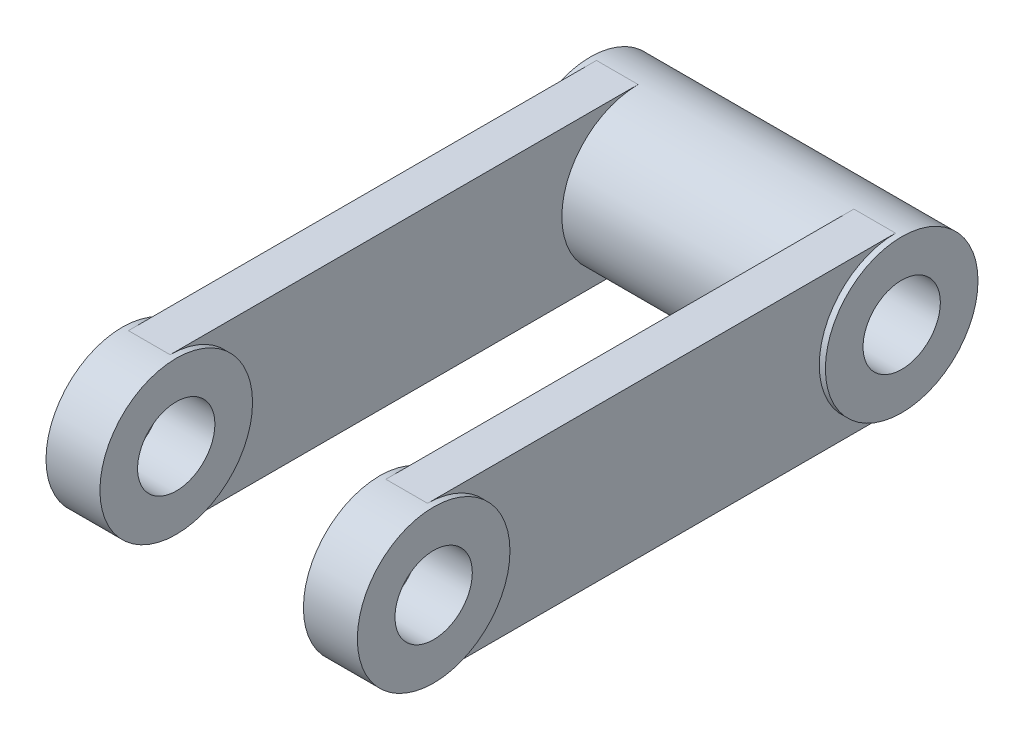
ISO-10303-21;
HEADER;
FILE_DESCRIPTION(('STEP AP214'),'2;1');
FILE_NAME('part.step','',(''),(''),'','','');
FILE_SCHEMA(('AUTOMOTIVE_DESIGN { 1 0 10303 214 1 1 1 1 }'));
ENDSEC;
DATA;
#1=APPLICATION_CONTEXT('core data for automotive mechanical design processes');
#2=APPLICATION_PROTOCOL_DEFINITION('international standard','automotive_design',2000,#1);
#3=PRODUCT_CONTEXT('',#1,'mechanical');
#4=PRODUCT('Part','Part','',(#3));
#5=PRODUCT_RELATED_PRODUCT_CATEGORY('part','',(#4));
#6=PRODUCT_DEFINITION_FORMATION('','',#4);
#7=PRODUCT_DEFINITION_CONTEXT('part definition',#1,'design');
#8=PRODUCT_DEFINITION('design','',#6,#7);
#9=PRODUCT_DEFINITION_SHAPE('','',#8);
#10=(LENGTH_UNIT() NAMED_UNIT(*) SI_UNIT(.MILLI.,.METRE.));
#11=(NAMED_UNIT(*) PLANE_ANGLE_UNIT() SI_UNIT($,.RADIAN.));
#12=(NAMED_UNIT(*) SI_UNIT($,.STERADIAN.) SOLID_ANGLE_UNIT());
#13=UNCERTAINTY_MEASURE_WITH_UNIT(LENGTH_MEASURE(1.E-05),#10,'distance_accuracy_value','');
#14=(GEOMETRIC_REPRESENTATION_CONTEXT(3) GLOBAL_UNCERTAINTY_ASSIGNED_CONTEXT((#13)) GLOBAL_UNIT_ASSIGNED_CONTEXT((#10,
#11,#12)) REPRESENTATION_CONTEXT('',''));
#15=CARTESIAN_POINT('',(0.,0.,0.));
#16=DIRECTION('',(0.,0.,1.));
#17=DIRECTION('',(1.,0.,0.));
#18=AXIS2_PLACEMENT_3D('',#15,#16,#17);
#19=CARTESIAN_POINT('',(153.,0.,0.));
#20=DIRECTION('',(-1.,0.,0.));
#21=DIRECTION('',(0.,0.,1.));
#22=AXIS2_PLACEMENT_3D('',#19,#20,#21);
#23=CYLINDRICAL_SURFACE('',#22,75.);
#24=DIRECTION('',(-1.,0.,0.));
#25=VECTOR('',#24,1.);
#26=CARTESIAN_POINT('',(147.,-75.,0.));
#27=LINE('',#26,#25);
#28=CARTESIAN_POINT('',(147.,-75.,0.));
#29=VERTEX_POINT('',#28);
#30=CARTESIAN_POINT('',(106.,-75.,0.));
#31=VERTEX_POINT('',#30);
#32=EDGE_CURVE('E51',#29,#31,#27,.T.);
#33=ORIENTED_EDGE('',*,*,#32,.F.);
#34=CARTESIAN_POINT('',(147.,0.,0.));
#35=DIRECTION('',(1.,0.,0.));
#36=DIRECTION('',(0.,0.,-1.));
#37=AXIS2_PLACEMENT_3D('',#34,#35,#36);
#38=CIRCLE('',#37,75.);
#39=CARTESIAN_POINT('',(147.,75.,0.));
#40=VERTEX_POINT('',#39);
#41=EDGE_CURVE('E56',#29,#40,#38,.T.);
#42=ORIENTED_EDGE('',*,*,#41,.T.);
#43=DIRECTION('',(-1.,0.,0.));
#44=VECTOR('',#43,1.);
#45=CARTESIAN_POINT('',(147.,75.,0.));
#46=LINE('',#45,#44);
#47=CARTESIAN_POINT('',(106.,75.,0.));
#48=VERTEX_POINT('',#47);
#49=EDGE_CURVE('E166',#40,#48,#46,.T.);
#50=ORIENTED_EDGE('',*,*,#49,.T.);
#51=CARTESIAN_POINT('',(106.,0.,0.));
#52=DIRECTION('',(1.,0.,0.));
#53=DIRECTION('',(0.,0.,-1.));
#54=AXIS2_PLACEMENT_3D('',#51,#52,#53);
#55=CIRCLE('',#54,75.);
#56=EDGE_CURVE('E155',#31,#48,#55,.T.);
#57=ORIENTED_EDGE('',*,*,#56,.F.);
#58=EDGE_LOOP('',(#33,#42,#50,#57));
#59=FACE_BOUND('',#58,.T.);
#60=CARTESIAN_POINT('',(153.,0.,0.));
#61=DIRECTION('',(1.,0.,0.));
#62=DIRECTION('',(0.,0.,-1.));
#63=AXIS2_PLACEMENT_3D('',#60,#61,#62);
#64=CIRCLE('',#63,75.);
#65=CARTESIAN_POINT('',(153.,0.,-75.));
#66=VERTEX_POINT('',#65);
#67=EDGE_CURVE('E43',#66,#66,#64,.T.);
#68=ORIENTED_EDGE('',*,*,#67,.F.);
#69=EDGE_LOOP('',(#68));
#70=FACE_BOUND('',#69,.T.);
#71=CARTESIAN_POINT('',(100.,0.,0.));
#72=DIRECTION('',(1.,0.,0.));
#73=DIRECTION('',(0.,0.,-1.));
#74=AXIS2_PLACEMENT_3D('',#71,#72,#73);
#75=CIRCLE('',#74,75.);
#76=CARTESIAN_POINT('',(100.,0.,-75.));
#77=VERTEX_POINT('',#76);
#78=EDGE_CURVE('E184',#77,#77,#75,.T.);
#79=ORIENTED_EDGE('',*,*,#78,.T.);
#80=EDGE_LOOP('',(#79));
#81=FACE_BOUND('',#80,.T.);
#82=ADVANCED_FACE('F35',(#59,#70,#81),#23,.T.);
#83=CARTESIAN_POINT('',(153.,0.,0.));
#84=DIRECTION('',(-1.,0.,0.));
#85=DIRECTION('',(0.,0.,1.));
#86=AXIS2_PLACEMENT_3D('',#83,#84,#85);
#87=CYLINDRICAL_SURFACE('',#86,38.);
#88=CARTESIAN_POINT('',(153.,0.,0.));
#89=DIRECTION('',(1.,0.,0.));
#90=DIRECTION('',(0.,0.,-1.));
#91=AXIS2_PLACEMENT_3D('',#88,#89,#90);
#92=CIRCLE('',#91,38.);
#93=CARTESIAN_POINT('',(153.,0.,-38.));
#94=VERTEX_POINT('',#93);
#95=EDGE_CURVE('E11',#94,#94,#92,.T.);
#96=ORIENTED_EDGE('',*,*,#95,.T.);
#97=EDGE_LOOP('',(#96));
#98=FACE_BOUND('',#97,.T.);
#99=CARTESIAN_POINT('',(100.,0.,0.));
#100=DIRECTION('',(1.,0.,0.));
#101=DIRECTION('',(0.,0.,-1.));
#102=AXIS2_PLACEMENT_3D('',#99,#100,#101);
#103=CIRCLE('',#102,38.);
#104=CARTESIAN_POINT('',(100.,0.,-38.));
#105=VERTEX_POINT('',#104);
#106=EDGE_CURVE('E38',#105,#105,#103,.T.);
#107=ORIENTED_EDGE('',*,*,#106,.F.);
#108=EDGE_LOOP('',(#107));
#109=FACE_BOUND('',#108,.T.);
#110=ADVANCED_FACE('F194',(#98,#109),#87,.F.);
#111=CARTESIAN_POINT('',(153.,0.,0.));
#112=DIRECTION('',(1.,0.,0.));
#113=DIRECTION('',(0.,0.,-1.));
#114=AXIS2_PLACEMENT_3D('',#111,#112,#113);
#115=PLANE('',#114);
#116=ORIENTED_EDGE('',*,*,#67,.T.);
#117=EDGE_LOOP('',(#116));
#118=FACE_BOUND('',#117,.T.);
#119=ORIENTED_EDGE('',*,*,#95,.F.);
#120=EDGE_LOOP('',(#119));
#121=FACE_BOUND('',#120,.T.);
#122=ADVANCED_FACE('F196',(#118,#121),#115,.T.);
#123=CARTESIAN_POINT('',(100.,0.,0.));
#124=DIRECTION('',(1.,0.,0.));
#125=DIRECTION('',(0.,0.,-1.));
#126=AXIS2_PLACEMENT_3D('',#123,#124,#125);
#127=PLANE('',#126);
#128=ORIENTED_EDGE('',*,*,#78,.F.);
#129=EDGE_LOOP('',(#128));
#130=FACE_BOUND('',#129,.T.);
#131=ORIENTED_EDGE('',*,*,#106,.T.);
#132=EDGE_LOOP('',(#131));
#133=FACE_BOUND('',#132,.T.);
#134=ADVANCED_FACE('F192',(#130,#133),#127,.F.);
#135=CARTESIAN_POINT('',(147.,-75.,0.));
#136=DIRECTION('',(0.,1.,0.));
#137=DIRECTION('',(0.,0.,1.));
#138=AXIS2_PLACEMENT_3D('',#135,#136,#137);
#139=PLANE('',#138);
#140=DIRECTION('',(0.,0.,-1.));
#141=VECTOR('',#140,1.);
#142=CARTESIAN_POINT('',(106.,-75.,0.));
#143=LINE('',#142,#141);
#144=CARTESIAN_POINT('',(106.,-75.,-460.));
#145=VERTEX_POINT('',#144);
#146=EDGE_CURVE('E169',#31,#145,#143,.T.);
#147=ORIENTED_EDGE('',*,*,#146,.T.);
#148=DIRECTION('',(-1.,0.,0.));
#149=VECTOR('',#148,1.);
#150=CARTESIAN_POINT('',(147.,-75.,-460.));
#151=LINE('',#150,#149);
#152=CARTESIAN_POINT('',(147.,-75.,-460.));
#153=VERTEX_POINT('',#152);
#154=EDGE_CURVE('E181',#153,#145,#151,.T.);
#155=ORIENTED_EDGE('',*,*,#154,.F.);
#156=DIRECTION('',(0.,0.,-1.));
#157=VECTOR('',#156,1.);
#158=CARTESIAN_POINT('',(147.,-75.,0.));
#159=LINE('',#158,#157);
#160=EDGE_CURVE('E157',#29,#153,#159,.T.);
#161=ORIENTED_EDGE('',*,*,#160,.F.);
#162=ORIENTED_EDGE('',*,*,#32,.T.);
#163=EDGE_LOOP('',(#147,#155,#161,#162));
#164=FACE_BOUND('',#163,.T.);
#165=ADVANCED_FACE('F206',(#164),#139,.F.);
#166=CARTESIAN_POINT('',(147.,75.,0.));
#167=DIRECTION('',(0.,1.,0.));
#168=DIRECTION('',(0.,0.,1.));
#169=AXIS2_PLACEMENT_3D('',#166,#167,#168);
#170=PLANE('',#169);
#171=DIRECTION('',(0.,0.,-1.));
#172=VECTOR('',#171,1.);
#173=CARTESIAN_POINT('',(106.,75.,0.));
#174=LINE('',#173,#172);
#175=CARTESIAN_POINT('',(106.,75.,-460.));
#176=VERTEX_POINT('',#175);
#177=EDGE_CURVE('E158',#48,#176,#174,.T.);
#178=ORIENTED_EDGE('',*,*,#177,.F.);
#179=ORIENTED_EDGE('',*,*,#49,.F.);
#180=DIRECTION('',(0.,0.,-1.));
#181=VECTOR('',#180,1.);
#182=CARTESIAN_POINT('',(147.,75.,0.));
#183=LINE('',#182,#181);
#184=CARTESIAN_POINT('',(147.,75.,-460.));
#185=VERTEX_POINT('',#184);
#186=EDGE_CURVE('E163',#40,#185,#183,.T.);
#187=ORIENTED_EDGE('',*,*,#186,.T.);
#188=DIRECTION('',(-1.,0.,0.));
#189=VECTOR('',#188,1.);
#190=CARTESIAN_POINT('',(147.,75.,-460.));
#191=LINE('',#190,#189);
#192=EDGE_CURVE('E178',#185,#176,#191,.T.);
#193=ORIENTED_EDGE('',*,*,#192,.T.);
#194=EDGE_LOOP('',(#178,#179,#187,#193));
#195=FACE_BOUND('',#194,.T.);
#196=ADVANCED_FACE('F211',(#195),#170,.T.);
#197=CARTESIAN_POINT('',(147.,0.,0.));
#198=DIRECTION('',(1.,0.,0.));
#199=DIRECTION('',(0.,0.,-1.));
#200=AXIS2_PLACEMENT_3D('',#197,#198,#199);
#201=PLANE('',#200);
#202=ORIENTED_EDGE('',*,*,#41,.F.);
#203=ORIENTED_EDGE('',*,*,#160,.T.);
#204=CARTESIAN_POINT('',(147.,0.,-460.));
#205=DIRECTION('',(1.,0.,0.));
#206=DIRECTION('',(0.,0.,-1.));
#207=AXIS2_PLACEMENT_3D('',#204,#205,#206);
#208=CIRCLE('',#207,75.);
#209=EDGE_CURVE('E161',#185,#153,#208,.T.);
#210=ORIENTED_EDGE('',*,*,#209,.F.);
#211=ORIENTED_EDGE('',*,*,#186,.F.);
#212=EDGE_LOOP('',(#202,#203,#210,#211));
#213=FACE_BOUND('',#212,.T.);
#214=ADVANCED_FACE('F215',(#213),#201,.T.);
#215=CARTESIAN_POINT('',(106.,0.,0.));
#216=DIRECTION('',(1.,0.,0.));
#217=DIRECTION('',(0.,0.,-1.));
#218=AXIS2_PLACEMENT_3D('',#215,#216,#217);
#219=PLANE('',#218);
#220=ORIENTED_EDGE('',*,*,#56,.T.);
#221=ORIENTED_EDGE('',*,*,#177,.T.);
#222=CARTESIAN_POINT('',(106.,0.,-460.));
#223=DIRECTION('',(1.,0.,0.));
#224=DIRECTION('',(0.,0.,-1.));
#225=AXIS2_PLACEMENT_3D('',#222,#223,#224);
#226=CIRCLE('',#225,75.);
#227=EDGE_CURVE('E172',#176,#145,#226,.T.);
#228=ORIENTED_EDGE('',*,*,#227,.T.);
#229=ORIENTED_EDGE('',*,*,#146,.F.);
#230=EDGE_LOOP('',(#220,#221,#228,#229));
#231=FACE_BOUND('',#230,.T.);
#232=ADVANCED_FACE('F217',(#231),#219,.F.);
#233=CARTESIAN_POINT('',(153.,0.,-460.));
#234=DIRECTION('',(-1.,0.,0.));
#235=DIRECTION('',(0.,0.,1.));
#236=AXIS2_PLACEMENT_3D('',#233,#234,#235);
#237=CYLINDRICAL_SURFACE('',#236,38.);
#238=CARTESIAN_POINT('',(153.,0.,-460.));
#239=DIRECTION('',(1.,0.,0.));
#240=DIRECTION('',(0.,0.,-1.));
#241=AXIS2_PLACEMENT_3D('',#238,#239,#240);
#242=CIRCLE('',#241,38.);
#243=CARTESIAN_POINT('',(153.,0.,-498.));
#244=VERTEX_POINT('',#243);
#245=EDGE_CURVE('E145',#244,#244,#242,.T.);
#246=ORIENTED_EDGE('',*,*,#245,.T.);
#247=EDGE_LOOP('',(#246));
#248=FACE_BOUND('',#247,.T.);
#249=CARTESIAN_POINT('',(-153.,0.,-460.));
#250=DIRECTION('',(1.,0.,0.));
#251=DIRECTION('',(0.,0.,-1.));
#252=AXIS2_PLACEMENT_3D('',#249,#250,#251);
#253=CIRCLE('',#252,38.);
#254=CARTESIAN_POINT('',(-153.,0.,-498.));
#255=VERTEX_POINT('',#254);
#256=EDGE_CURVE('E271',#255,#255,#253,.T.);
#257=ORIENTED_EDGE('',*,*,#256,.F.);
#258=EDGE_LOOP('',(#257));
#259=FACE_BOUND('',#258,.T.);
#260=ADVANCED_FACE('F220',(#248,#259),#237,.F.);
#261=CARTESIAN_POINT('',(153.,0.,-460.));
#262=DIRECTION('',(-1.,0.,0.));
#263=DIRECTION('',(0.,0.,1.));
#264=AXIS2_PLACEMENT_3D('',#261,#262,#263);
#265=CYLINDRICAL_SURFACE('',#264,75.);
#266=ORIENTED_EDGE('',*,*,#209,.T.);
#267=ORIENTED_EDGE('',*,*,#154,.T.);
#268=ORIENTED_EDGE('',*,*,#227,.F.);
#269=ORIENTED_EDGE('',*,*,#192,.F.);
#270=EDGE_LOOP('',(#266,#267,#268,#269));
#271=FACE_BOUND('',#270,.T.);
#272=CARTESIAN_POINT('',(153.,0.,-460.));
#273=DIRECTION('',(1.,0.,0.));
#274=DIRECTION('',(0.,0.,-1.));
#275=AXIS2_PLACEMENT_3D('',#272,#273,#274);
#276=CIRCLE('',#275,75.);
#277=CARTESIAN_POINT('',(153.,0.,-535.));
#278=VERTEX_POINT('',#277);
#279=EDGE_CURVE('E152',#278,#278,#276,.T.);
#280=ORIENTED_EDGE('',*,*,#279,.F.);
#281=EDGE_LOOP('',(#280));
#282=FACE_BOUND('',#281,.T.);
#283=CARTESIAN_POINT('',(-147.,0.,-460.));
#284=DIRECTION('',(1.,0.,0.));
#285=DIRECTION('',(0.,0.,-1.));
#286=AXIS2_PLACEMENT_3D('',#283,#284,#285);
#287=CIRCLE('',#286,75.);
#288=CARTESIAN_POINT('',(-147.,75.,-460.));
#289=VERTEX_POINT('',#288);
#290=CARTESIAN_POINT('',(-147.,-75.,-460.));
#291=VERTEX_POINT('',#290);
#292=EDGE_CURVE('E115',#289,#291,#287,.T.);
#293=ORIENTED_EDGE('',*,*,#292,.F.);
#294=DIRECTION('',(1.,0.,0.));
#295=VECTOR('',#294,1.);
#296=CARTESIAN_POINT('',(-147.,75.,-460.));
#297=LINE('',#296,#295);
#298=CARTESIAN_POINT('',(-106.,75.,-460.));
#299=VERTEX_POINT('',#298);
#300=EDGE_CURVE('E112',#289,#299,#297,.T.);
#301=ORIENTED_EDGE('',*,*,#300,.T.);
#302=CARTESIAN_POINT('',(-106.,0.,-460.));
#303=DIRECTION('',(1.,0.,0.));
#304=DIRECTION('',(0.,0.,-1.));
#305=AXIS2_PLACEMENT_3D('',#302,#303,#304);
#306=CIRCLE('',#305,75.);
#307=CARTESIAN_POINT('',(-106.,-75.,-460.));
#308=VERTEX_POINT('',#307);
#309=EDGE_CURVE('E99',#299,#308,#306,.T.);
#310=ORIENTED_EDGE('',*,*,#309,.T.);
#311=DIRECTION('',(1.,0.,0.));
#312=VECTOR('',#311,1.);
#313=CARTESIAN_POINT('',(-147.,-75.,-460.));
#314=LINE('',#313,#312);
#315=EDGE_CURVE('E118',#291,#308,#314,.T.);
#316=ORIENTED_EDGE('',*,*,#315,.F.);
#317=EDGE_LOOP('',(#293,#301,#310,#316));
#318=FACE_BOUND('',#317,.T.);
#319=CARTESIAN_POINT('',(-153.,0.,-460.));
#320=DIRECTION('',(1.,0.,0.));
#321=DIRECTION('',(0.,0.,-1.));
#322=AXIS2_PLACEMENT_3D('',#319,#320,#321);
#323=CIRCLE('',#322,75.);
#324=CARTESIAN_POINT('',(-153.,0.,-535.));
#325=VERTEX_POINT('',#324);
#326=EDGE_CURVE('E274',#325,#325,#323,.T.);
#327=ORIENTED_EDGE('',*,*,#326,.T.);
#328=EDGE_LOOP('',(#327));
#329=FACE_BOUND('',#328,.T.);
#330=ADVANCED_FACE('F113',(#271,#282,#318,#329),#265,.T.);
#331=CARTESIAN_POINT('',(153.,0.,0.));
#332=DIRECTION('',(1.,0.,0.));
#333=DIRECTION('',(0.,0.,-1.));
#334=AXIS2_PLACEMENT_3D('',#331,#332,#333);
#335=PLANE('',#334);
#336=ORIENTED_EDGE('',*,*,#245,.F.);
#337=EDGE_LOOP('',(#336));
#338=FACE_BOUND('',#337,.T.);
#339=ORIENTED_EDGE('',*,*,#279,.T.);
#340=EDGE_LOOP('',(#339));
#341=FACE_BOUND('',#340,.T.);
#342=ADVANCED_FACE('F230',(#338,#341),#335,.T.);
#343=CARTESIAN_POINT('',(-153.,0.,0.));
#344=DIRECTION('',(1.,0.,0.));
#345=DIRECTION('',(0.,0.,1.));
#346=AXIS2_PLACEMENT_3D('',#343,#344,#345);
#347=CYLINDRICAL_SURFACE('',#346,75.);
#348=DIRECTION('',(1.,0.,0.));
#349=VECTOR('',#348,1.);
#350=CARTESIAN_POINT('',(-147.,-75.,0.));
#351=LINE('',#350,#349);
#352=CARTESIAN_POINT('',(-147.,-75.,0.));
#353=VERTEX_POINT('',#352);
#354=CARTESIAN_POINT('',(-106.,-75.,0.));
#355=VERTEX_POINT('',#354);
#356=EDGE_CURVE('E134',#353,#355,#351,.T.);
#357=ORIENTED_EDGE('',*,*,#356,.T.);
#358=CARTESIAN_POINT('',(-106.,0.,0.));
#359=DIRECTION('',(1.,0.,0.));
#360=DIRECTION('',(0.,0.,-1.));
#361=AXIS2_PLACEMENT_3D('',#358,#359,#360);
#362=CIRCLE('',#361,75.);
#363=CARTESIAN_POINT('',(-106.,75.,0.));
#364=VERTEX_POINT('',#363);
#365=EDGE_CURVE('E275',#355,#364,#362,.T.);
#366=ORIENTED_EDGE('',*,*,#365,.T.);
#367=DIRECTION('',(1.,0.,0.));
#368=VECTOR('',#367,1.);
#369=CARTESIAN_POINT('',(-147.,75.,0.));
#370=LINE('',#369,#368);
#371=CARTESIAN_POINT('',(-147.,75.,0.));
#372=VERTEX_POINT('',#371);
#373=EDGE_CURVE('E119',#372,#364,#370,.T.);
#374=ORIENTED_EDGE('',*,*,#373,.F.);
#375=CARTESIAN_POINT('',(-147.,0.,0.));
#376=DIRECTION('',(1.,0.,0.));
#377=DIRECTION('',(0.,0.,-1.));
#378=AXIS2_PLACEMENT_3D('',#375,#376,#377);
#379=CIRCLE('',#378,75.);
#380=EDGE_CURVE('E124',#353,#372,#379,.T.);
#381=ORIENTED_EDGE('',*,*,#380,.F.);
#382=EDGE_LOOP('',(#357,#366,#374,#381));
#383=FACE_BOUND('',#382,.T.);
#384=CARTESIAN_POINT('',(-153.,0.,0.));
#385=DIRECTION('',(1.,0.,0.));
#386=DIRECTION('',(0.,0.,-1.));
#387=AXIS2_PLACEMENT_3D('',#384,#385,#386);
#388=CIRCLE('',#387,75.);
#389=CARTESIAN_POINT('',(-153.,0.,-75.));
#390=VERTEX_POINT('',#389);
#391=EDGE_CURVE('E138',#390,#390,#388,.T.);
#392=ORIENTED_EDGE('',*,*,#391,.T.);
#393=EDGE_LOOP('',(#392));
#394=FACE_BOUND('',#393,.T.);
#395=CARTESIAN_POINT('',(-100.,0.,0.));
#396=DIRECTION('',(1.,0.,0.));
#397=DIRECTION('',(0.,0.,-1.));
#398=AXIS2_PLACEMENT_3D('',#395,#396,#397);
#399=CIRCLE('',#398,75.);
#400=CARTESIAN_POINT('',(-100.,0.,-75.));
#401=VERTEX_POINT('',#400);
#402=EDGE_CURVE('E137',#401,#401,#399,.T.);
#403=ORIENTED_EDGE('',*,*,#402,.F.);
#404=EDGE_LOOP('',(#403));
#405=FACE_BOUND('',#404,.T.);
#406=ADVANCED_FACE('F234',(#383,#394,#405),#347,.T.);
#407=CARTESIAN_POINT('',(-153.,0.,0.));
#408=DIRECTION('',(1.,0.,0.));
#409=DIRECTION('',(0.,0.,1.));
#410=AXIS2_PLACEMENT_3D('',#407,#408,#409);
#411=CYLINDRICAL_SURFACE('',#410,38.);
#412=CARTESIAN_POINT('',(-153.,0.,0.));
#413=DIRECTION('',(1.,0.,0.));
#414=DIRECTION('',(0.,0.,-1.));
#415=AXIS2_PLACEMENT_3D('',#412,#413,#414);
#416=CIRCLE('',#415,38.);
#417=CARTESIAN_POINT('',(-153.,0.,-38.));
#418=VERTEX_POINT('',#417);
#419=EDGE_CURVE('E141',#418,#418,#416,.T.);
#420=ORIENTED_EDGE('',*,*,#419,.F.);
#421=EDGE_LOOP('',(#420));
#422=FACE_BOUND('',#421,.T.);
#423=CARTESIAN_POINT('',(-100.,0.,0.));
#424=DIRECTION('',(1.,0.,0.));
#425=DIRECTION('',(0.,0.,-1.));
#426=AXIS2_PLACEMENT_3D('',#423,#424,#425);
#427=CIRCLE('',#426,38.);
#428=CARTESIAN_POINT('',(-100.,0.,-38.));
#429=VERTEX_POINT('',#428);
#430=EDGE_CURVE('E142',#429,#429,#427,.T.);
#431=ORIENTED_EDGE('',*,*,#430,.T.);
#432=EDGE_LOOP('',(#431));
#433=FACE_BOUND('',#432,.T.);
#434=ADVANCED_FACE('F238',(#422,#433),#411,.F.);
#435=CARTESIAN_POINT('',(-153.,0.,0.));
#436=DIRECTION('',(-1.,0.,0.));
#437=DIRECTION('',(0.,0.,-1.));
#438=AXIS2_PLACEMENT_3D('',#435,#436,#437);
#439=PLANE('',#438);
#440=ORIENTED_EDGE('',*,*,#391,.F.);
#441=EDGE_LOOP('',(#440));
#442=FACE_BOUND('',#441,.T.);
#443=ORIENTED_EDGE('',*,*,#419,.T.);
#444=EDGE_LOOP('',(#443));
#445=FACE_BOUND('',#444,.T.);
#446=ADVANCED_FACE('F242',(#442,#445),#439,.T.);
#447=CARTESIAN_POINT('',(-100.,0.,0.));
#448=DIRECTION('',(-1.,0.,0.));
#449=DIRECTION('',(0.,0.,-1.));
#450=AXIS2_PLACEMENT_3D('',#447,#448,#449);
#451=PLANE('',#450);
#452=ORIENTED_EDGE('',*,*,#402,.T.);
#453=EDGE_LOOP('',(#452));
#454=FACE_BOUND('',#453,.T.);
#455=ORIENTED_EDGE('',*,*,#430,.F.);
#456=EDGE_LOOP('',(#455));
#457=FACE_BOUND('',#456,.T.);
#458=ADVANCED_FACE('F244',(#454,#457),#451,.F.);
#459=CARTESIAN_POINT('',(-147.,-75.,0.));
#460=DIRECTION('',(0.,1.,0.));
#461=DIRECTION('',(0.,0.,1.));
#462=AXIS2_PLACEMENT_3D('',#459,#460,#461);
#463=PLANE('',#462);
#464=DIRECTION('',(0.,0.,-1.));
#465=VECTOR('',#464,1.);
#466=CARTESIAN_POINT('',(-106.,-75.,0.));
#467=LINE('',#466,#465);
#468=EDGE_CURVE('E106',#355,#308,#467,.T.);
#469=ORIENTED_EDGE('',*,*,#468,.F.);
#470=ORIENTED_EDGE('',*,*,#356,.F.);
#471=DIRECTION('',(0.,0.,-1.));
#472=VECTOR('',#471,1.);
#473=CARTESIAN_POINT('',(-147.,-75.,0.));
#474=LINE('',#473,#472);
#475=EDGE_CURVE('E127',#353,#291,#474,.T.);
#476=ORIENTED_EDGE('',*,*,#475,.T.);
#477=ORIENTED_EDGE('',*,*,#315,.T.);
#478=EDGE_LOOP('',(#469,#470,#476,#477));
#479=FACE_BOUND('',#478,.T.);
#480=ADVANCED_FACE('F247',(#479),#463,.F.);
#481=CARTESIAN_POINT('',(-147.,75.,0.));
#482=DIRECTION('',(0.,1.,0.));
#483=DIRECTION('',(0.,0.,1.));
#484=AXIS2_PLACEMENT_3D('',#481,#482,#483);
#485=PLANE('',#484);
#486=DIRECTION('',(0.,0.,-1.));
#487=VECTOR('',#486,1.);
#488=CARTESIAN_POINT('',(-106.,75.,0.));
#489=LINE('',#488,#487);
#490=EDGE_CURVE('E104',#364,#299,#489,.T.);
#491=ORIENTED_EDGE('',*,*,#490,.T.);
#492=ORIENTED_EDGE('',*,*,#300,.F.);
#493=DIRECTION('',(0.,0.,-1.));
#494=VECTOR('',#493,1.);
#495=CARTESIAN_POINT('',(-147.,75.,0.));
#496=LINE('',#495,#494);
#497=EDGE_CURVE('E131',#372,#289,#496,.T.);
#498=ORIENTED_EDGE('',*,*,#497,.F.);
#499=ORIENTED_EDGE('',*,*,#373,.T.);
#500=EDGE_LOOP('',(#491,#492,#498,#499));
#501=FACE_BOUND('',#500,.T.);
#502=ADVANCED_FACE('F121',(#501),#485,.T.);
#503=CARTESIAN_POINT('',(-147.,0.,0.));
#504=DIRECTION('',(-1.,0.,0.));
#505=DIRECTION('',(0.,0.,-1.));
#506=AXIS2_PLACEMENT_3D('',#503,#504,#505);
#507=PLANE('',#506);
#508=ORIENTED_EDGE('',*,*,#380,.T.);
#509=ORIENTED_EDGE('',*,*,#497,.T.);
#510=ORIENTED_EDGE('',*,*,#292,.T.);
#511=ORIENTED_EDGE('',*,*,#475,.F.);
#512=EDGE_LOOP('',(#508,#509,#510,#511));
#513=FACE_BOUND('',#512,.T.);
#514=ADVANCED_FACE('F257',(#513),#507,.T.);
#515=CARTESIAN_POINT('',(-106.,0.,0.));
#516=DIRECTION('',(-1.,0.,0.));
#517=DIRECTION('',(0.,0.,-1.));
#518=AXIS2_PLACEMENT_3D('',#515,#516,#517);
#519=PLANE('',#518);
#520=ORIENTED_EDGE('',*,*,#365,.F.);
#521=ORIENTED_EDGE('',*,*,#468,.T.);
#522=ORIENTED_EDGE('',*,*,#309,.F.);
#523=ORIENTED_EDGE('',*,*,#490,.F.);
#524=EDGE_LOOP('',(#520,#521,#522,#523));
#525=FACE_BOUND('',#524,.T.);
#526=ADVANCED_FACE('F102',(#525),#519,.F.);
#527=CARTESIAN_POINT('',(-153.,0.,0.));
#528=DIRECTION('',(-1.,0.,0.));
#529=DIRECTION('',(0.,0.,-1.));
#530=AXIS2_PLACEMENT_3D('',#527,#528,#529);
#531=PLANE('',#530);
#532=ORIENTED_EDGE('',*,*,#256,.T.);
#533=EDGE_LOOP('',(#532));
#534=FACE_BOUND('',#533,.T.);
#535=ORIENTED_EDGE('',*,*,#326,.F.);
#536=EDGE_LOOP('',(#535));
#537=FACE_BOUND('',#536,.T.);
#538=ADVANCED_FACE('F260',(#534,#537),#531,.T.);
#539=CLOSED_SHELL('',(#82,#110,#122,#134,#165,#196,#214,#232,#260,#330,#342,#406,#434,#446,#458,
#480,#502,#514,#526,#538));
#540=MANIFOLD_SOLID_BREP('B2',#539);
#541=ADVANCED_BREP_SHAPE_REPRESENTATION('',(#18,#540),#14);
#542=SHAPE_DEFINITION_REPRESENTATION(#9,#541);
ENDSEC;
END-ISO-10303-21;
